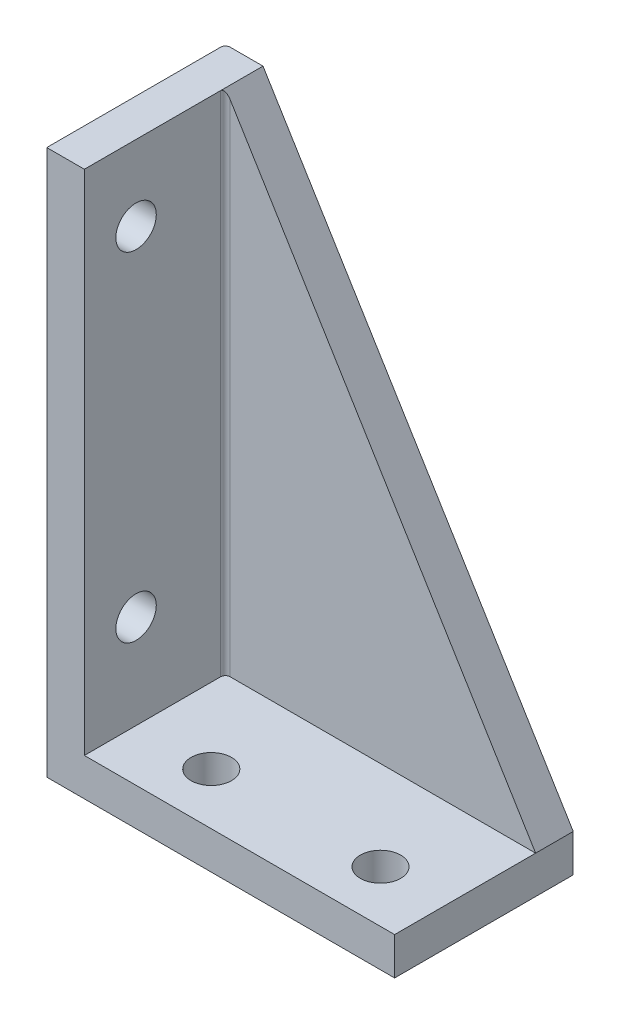
ISO-10303-21;
HEADER;
FILE_DESCRIPTION(('STEP AP214'),'2;1');
FILE_NAME('part.step','',(''),(''),'','','');
FILE_SCHEMA(('AUTOMOTIVE_DESIGN { 1 0 10303 214 1 1 1 1 }'));
ENDSEC;
DATA;
#1=APPLICATION_CONTEXT('core data for automotive mechanical design processes');
#2=APPLICATION_PROTOCOL_DEFINITION('international standard','automotive_design',2000,#1);
#3=PRODUCT_CONTEXT('',#1,'mechanical');
#4=PRODUCT('Part','Part','',(#3));
#5=PRODUCT_RELATED_PRODUCT_CATEGORY('part','',(#4));
#6=PRODUCT_DEFINITION_FORMATION('','',#4);
#7=PRODUCT_DEFINITION_CONTEXT('part definition',#1,'design');
#8=PRODUCT_DEFINITION('design','',#6,#7);
#9=PRODUCT_DEFINITION_SHAPE('','',#8);
#10=(LENGTH_UNIT() NAMED_UNIT(*) SI_UNIT(.MILLI.,.METRE.));
#11=(NAMED_UNIT(*) PLANE_ANGLE_UNIT() SI_UNIT($,.RADIAN.));
#12=(NAMED_UNIT(*) SI_UNIT($,.STERADIAN.) SOLID_ANGLE_UNIT());
#13=UNCERTAINTY_MEASURE_WITH_UNIT(LENGTH_MEASURE(1.E-05),#10,'distance_accuracy_value','');
#14=(GEOMETRIC_REPRESENTATION_CONTEXT(3) GLOBAL_UNCERTAINTY_ASSIGNED_CONTEXT((#13)) GLOBAL_UNIT_ASSIGNED_CONTEXT((#10,
#11,#12)) REPRESENTATION_CONTEXT('',''));
#15=CARTESIAN_POINT('',(0.,0.,0.));
#16=DIRECTION('',(0.,0.,1.));
#17=DIRECTION('',(1.,0.,0.));
#18=AXIS2_PLACEMENT_3D('',#15,#16,#17);
#19=CARTESIAN_POINT('',(0.,58.,30.));
#20=DIRECTION('',(0.,-1.,0.));
#21=DIRECTION('',(0.,0.,-1.));
#22=AXIS2_PLACEMENT_3D('',#19,#20,#21);
#23=PLANE('',#22);
#24=DIRECTION('',(1.,0.,0.));
#25=VECTOR('',#24,1.);
#26=CARTESIAN_POINT('',(37.,58.,13.));
#27=LINE('',#26,#25);
#28=CARTESIAN_POINT('',(0.5,58.,13.));
#29=VERTEX_POINT('',#28);
#30=CARTESIAN_POINT('',(4.00000000000001,58.,13.));
#31=VERTEX_POINT('',#30);
#32=EDGE_CURVE('E137',#29,#31,#27,.T.);
#33=ORIENTED_EDGE('',*,*,#32,.F.);
#34=CARTESIAN_POINT('',(0.5,58.,13.5));
#35=DIRECTION('',(0.,-1.,0.));
#36=DIRECTION('',(0.,0.,-1.));
#37=AXIS2_PLACEMENT_3D('',#34,#35,#36);
#38=CIRCLE('',#37,0.5);
#39=CARTESIAN_POINT('',(0.,58.,13.5));
#40=VERTEX_POINT('',#39);
#41=EDGE_CURVE('E198',#29,#40,#38,.F.);
#42=ORIENTED_EDGE('',*,*,#41,.T.);
#43=DIRECTION('',(0.,0.,-1.));
#44=VECTOR('',#43,1.);
#45=CARTESIAN_POINT('',(0.,58.,30.));
#46=LINE('',#45,#44);
#47=CARTESIAN_POINT('',(0.,58.,32.));
#48=VERTEX_POINT('',#47);
#49=EDGE_CURVE('E188',#48,#40,#46,.T.);
#50=ORIENTED_EDGE('',*,*,#49,.F.);
#51=DIRECTION('',(-1.,0.,0.));
#52=VECTOR('',#51,1.);
#53=CARTESIAN_POINT('',(0.,58.,32.));
#54=LINE('',#53,#52);
#55=CARTESIAN_POINT('',(4.,58.,32.));
#56=VERTEX_POINT('',#55);
#57=EDGE_CURVE('E127',#56,#48,#54,.T.);
#58=ORIENTED_EDGE('',*,*,#57,.F.);
#59=DIRECTION('',(0.,0.,-1.));
#60=VECTOR('',#59,1.);
#61=CARTESIAN_POINT('',(4.,58.,0.));
#62=LINE('',#61,#60);
#63=CARTESIAN_POINT('',(4.,58.,17.5));
#64=VERTEX_POINT('',#63);
#65=EDGE_CURVE('E179',#56,#64,#62,.T.);
#66=ORIENTED_EDGE('',*,*,#65,.T.);
#67=DIRECTION('',(0.,0.,-1.));
#68=VECTOR('',#67,1.);
#69=CARTESIAN_POINT('',(4.,58.,59.));
#70=LINE('',#69,#68);
#71=EDGE_CURVE('E174',#64,#31,#70,.T.);
#72=ORIENTED_EDGE('',*,*,#71,.T.);
#73=EDGE_LOOP('',(#33,#42,#50,#58,#66,#72));
#74=FACE_BOUND('',#73,.T.);
#75=ADVANCED_FACE('F34',(#74),#23,.F.);
#76=CARTESIAN_POINT('',(37.,0.,30.));
#77=DIRECTION('',(-1.,0.,0.));
#78=DIRECTION('',(0.,0.,1.));
#79=AXIS2_PLACEMENT_3D('',#76,#77,#78);
#80=PLANE('',#79);
#81=DIRECTION('',(0.,-1.,0.));
#82=VECTOR('',#81,1.);
#83=CARTESIAN_POINT('',(37.,58.,13.));
#84=LINE('',#83,#82);
#85=CARTESIAN_POINT('',(37.,4.,13.));
#86=VERTEX_POINT('',#85);
#87=CARTESIAN_POINT('',(37.,0.,13.));
#88=VERTEX_POINT('',#87);
#89=EDGE_CURVE('E139',#86,#88,#84,.T.);
#90=ORIENTED_EDGE('',*,*,#89,.F.);
#91=DIRECTION('',(0.,0.,-1.));
#92=VECTOR('',#91,1.);
#93=CARTESIAN_POINT('',(37.,4.,59.));
#94=LINE('',#93,#92);
#95=CARTESIAN_POINT('',(37.,4.,17.));
#96=VERTEX_POINT('',#95);
#97=EDGE_CURVE('E171',#96,#86,#94,.T.);
#98=ORIENTED_EDGE('',*,*,#97,.F.);
#99=DIRECTION('',(0.,0.,-1.));
#100=VECTOR('',#99,1.);
#101=CARTESIAN_POINT('',(37.,4.,0.));
#102=LINE('',#101,#100);
#103=CARTESIAN_POINT('',(37.,4.,32.));
#104=VERTEX_POINT('',#103);
#105=EDGE_CURVE('E183',#104,#96,#102,.T.);
#106=ORIENTED_EDGE('',*,*,#105,.F.);
#107=DIRECTION('',(0.,1.,0.));
#108=VECTOR('',#107,1.);
#109=CARTESIAN_POINT('',(37.,4.,32.));
#110=LINE('',#109,#108);
#111=CARTESIAN_POINT('',(37.,0.,32.));
#112=VERTEX_POINT('',#111);
#113=EDGE_CURVE('E121',#112,#104,#110,.T.);
#114=ORIENTED_EDGE('',*,*,#113,.F.);
#115=DIRECTION('',(0.,0.,-1.));
#116=VECTOR('',#115,1.);
#117=CARTESIAN_POINT('',(37.,0.,30.));
#118=LINE('',#117,#116);
#119=EDGE_CURVE('E111',#112,#88,#118,.T.);
#120=ORIENTED_EDGE('',*,*,#119,.T.);
#121=EDGE_LOOP('',(#90,#98,#106,#114,#120));
#122=FACE_BOUND('',#121,.T.);
#123=ADVANCED_FACE('F232',(#122),#80,.F.);
#124=CARTESIAN_POINT('',(0.,0.,30.));
#125=DIRECTION('',(1.,0.,0.));
#126=DIRECTION('',(0.,0.,-1.));
#127=AXIS2_PLACEMENT_3D('',#124,#125,#126);
#128=PLANE('',#127);
#129=CARTESIAN_POINT('',(0.,50.,26.5));
#130=DIRECTION('',(1.,0.,0.));
#131=DIRECTION('',(0.,0.,-1.));
#132=AXIS2_PLACEMENT_3D('',#129,#130,#131);
#133=CIRCLE('',#132,2.15);
#134=CARTESIAN_POINT('',(0.,50.,24.35));
#135=VERTEX_POINT('',#134);
#136=EDGE_CURVE('E165',#135,#135,#133,.T.);
#137=ORIENTED_EDGE('',*,*,#136,.T.);
#138=EDGE_LOOP('',(#137));
#139=FACE_BOUND('',#138,.T.);
#140=CARTESIAN_POINT('',(0.,14.,26.5));
#141=DIRECTION('',(1.,0.,0.));
#142=DIRECTION('',(0.,0.,-1.));
#143=AXIS2_PLACEMENT_3D('',#140,#141,#142);
#144=CIRCLE('',#143,2.15);
#145=CARTESIAN_POINT('',(0.,14.,24.35));
#146=VERTEX_POINT('',#145);
#147=EDGE_CURVE('E159',#146,#146,#144,.T.);
#148=ORIENTED_EDGE('',*,*,#147,.T.);
#149=EDGE_LOOP('',(#148));
#150=FACE_BOUND('',#149,.T.);
#151=ORIENTED_EDGE('',*,*,#49,.T.);
#152=DIRECTION('',(0.,-1.,0.));
#153=VECTOR('',#152,1.);
#154=CARTESIAN_POINT('',(0.,0.,13.5));
#155=LINE('',#154,#153);
#156=CARTESIAN_POINT('',(0.,0.,13.5));
#157=VERTEX_POINT('',#156);
#158=EDGE_CURVE('E109',#40,#157,#155,.T.);
#159=ORIENTED_EDGE('',*,*,#158,.T.);
#160=DIRECTION('',(0.,0.,-1.));
#161=VECTOR('',#160,1.);
#162=CARTESIAN_POINT('',(0.,0.,30.));
#163=LINE('',#162,#161);
#164=CARTESIAN_POINT('',(0.,0.,32.));
#165=VERTEX_POINT('',#164);
#166=EDGE_CURVE('E102',#165,#157,#163,.T.);
#167=ORIENTED_EDGE('',*,*,#166,.F.);
#168=DIRECTION('',(0.,-1.,0.));
#169=VECTOR('',#168,1.);
#170=CARTESIAN_POINT('',(0.,0.,32.));
#171=LINE('',#170,#169);
#172=EDGE_CURVE('E107',#48,#165,#171,.T.);
#173=ORIENTED_EDGE('',*,*,#172,.F.);
#174=EDGE_LOOP('',(#151,#159,#167,#173));
#175=FACE_BOUND('',#174,.T.);
#176=ADVANCED_FACE('F105',(#139,#150,#175),#128,.F.);
#177=CARTESIAN_POINT('',(0.,0.,30.));
#178=DIRECTION('',(0.,1.,0.));
#179=DIRECTION('',(0.,0.,1.));
#180=AXIS2_PLACEMENT_3D('',#177,#178,#179);
#181=PLANE('',#180);
#182=CARTESIAN_POINT('',(30.,0.,26.5));
#183=DIRECTION('',(0.,1.,0.));
#184=DIRECTION('',(0.,0.,1.));
#185=AXIS2_PLACEMENT_3D('',#182,#183,#184);
#186=CIRCLE('',#185,2.15);
#187=CARTESIAN_POINT('',(30.,0.,28.65));
#188=VERTEX_POINT('',#187);
#189=EDGE_CURVE('E153',#188,#188,#186,.T.);
#190=ORIENTED_EDGE('',*,*,#189,.T.);
#191=EDGE_LOOP('',(#190));
#192=FACE_BOUND('',#191,.T.);
#193=CARTESIAN_POINT('',(12.,0.,26.5));
#194=DIRECTION('',(0.,1.,0.));
#195=DIRECTION('',(0.,0.,1.));
#196=AXIS2_PLACEMENT_3D('',#193,#194,#195);
#197=CIRCLE('',#196,2.15);
#198=CARTESIAN_POINT('',(12.,0.,28.65));
#199=VERTEX_POINT('',#198);
#200=EDGE_CURVE('E147',#199,#199,#197,.T.);
#201=ORIENTED_EDGE('',*,*,#200,.T.);
#202=EDGE_LOOP('',(#201));
#203=FACE_BOUND('',#202,.T.);
#204=ORIENTED_EDGE('',*,*,#166,.T.);
#205=CARTESIAN_POINT('',(0.5,0.,13.5));
#206=DIRECTION('',(0.,1.,0.));
#207=DIRECTION('',(0.,0.,1.));
#208=AXIS2_PLACEMENT_3D('',#205,#206,#207);
#209=CIRCLE('',#208,0.5);
#210=CARTESIAN_POINT('',(0.5,0.,13.));
#211=VERTEX_POINT('',#210);
#212=EDGE_CURVE('E194',#157,#211,#209,.F.);
#213=ORIENTED_EDGE('',*,*,#212,.T.);
#214=DIRECTION('',(-1.,0.,0.));
#215=VECTOR('',#214,1.);
#216=CARTESIAN_POINT('',(0.,0.,13.));
#217=LINE('',#216,#215);
#218=EDGE_CURVE('E141',#88,#211,#217,.T.);
#219=ORIENTED_EDGE('',*,*,#218,.F.);
#220=ORIENTED_EDGE('',*,*,#119,.F.);
#221=DIRECTION('',(1.,0.,0.));
#222=VECTOR('',#221,1.);
#223=CARTESIAN_POINT('',(37.,0.,32.));
#224=LINE('',#223,#222);
#225=EDGE_CURVE('E114',#165,#112,#224,.T.);
#226=ORIENTED_EDGE('',*,*,#225,.F.);
#227=EDGE_LOOP('',(#204,#213,#219,#220,#226));
#228=FACE_BOUND('',#227,.T.);
#229=ADVANCED_FACE('F115',(#192,#203,#228),#181,.F.);
#230=CARTESIAN_POINT('',(0.,4.,13.));
#231=DIRECTION('',(0.,0.,-1.));
#232=DIRECTION('',(-1.,0.,0.));
#233=AXIS2_PLACEMENT_3D('',#230,#231,#232);
#234=PLANE('',#233);
#235=ORIENTED_EDGE('',*,*,#218,.T.);
#236=DIRECTION('',(0.,-1.,0.));
#237=VECTOR('',#236,1.);
#238=CARTESIAN_POINT('',(0.5,58.,13.));
#239=LINE('',#238,#237);
#240=EDGE_CURVE('E196',#211,#29,#239,.F.);
#241=ORIENTED_EDGE('',*,*,#240,.T.);
#242=ORIENTED_EDGE('',*,*,#32,.T.);
#243=DIRECTION('',(0.521450009453975,-0.853281833651959,0.));
#244=VECTOR('',#243,1.);
#245=CARTESIAN_POINT('',(4.,58.,13.));
#246=LINE('',#245,#244);
#247=EDGE_CURVE('E168',#31,#86,#246,.T.);
#248=ORIENTED_EDGE('',*,*,#247,.T.);
#249=ORIENTED_EDGE('',*,*,#89,.T.);
#250=EDGE_LOOP('',(#235,#241,#242,#248,#249));
#251=FACE_BOUND('',#250,.T.);
#252=ADVANCED_FACE('F220',(#251),#234,.T.);
#253=CARTESIAN_POINT('',(0.,4.,17.));
#254=DIRECTION('',(0.,0.,-1.));
#255=DIRECTION('',(-1.,0.,0.));
#256=AXIS2_PLACEMENT_3D('',#253,#254,#255);
#257=PLANE('',#256);
#258=DIRECTION('',(0.521450009453975,-0.853281833651959,0.));
#259=VECTOR('',#258,1.);
#260=CARTESIAN_POINT('',(26.9393258426966,20.4629213483146,17.));
#261=LINE('',#260,#259);
#262=CARTESIAN_POINT('',(4.5,57.1818181818182,17.));
#263=VERTEX_POINT('',#262);
#264=EDGE_CURVE('E177',#263,#96,#261,.T.);
#265=ORIENTED_EDGE('',*,*,#264,.F.);
#266=DIRECTION('',(0.,1.,0.));
#267=VECTOR('',#266,1.);
#268=CARTESIAN_POINT('',(4.5,4.,17.));
#269=LINE('',#268,#267);
#270=CARTESIAN_POINT('',(4.5,4.,17.));
#271=VERTEX_POINT('',#270);
#272=EDGE_CURVE('E50',#263,#271,#269,.F.);
#273=ORIENTED_EDGE('',*,*,#272,.T.);
#274=DIRECTION('',(-1.,0.,0.));
#275=VECTOR('',#274,1.);
#276=CARTESIAN_POINT('',(0.,4.,17.));
#277=LINE('',#276,#275);
#278=EDGE_CURVE('E186',#96,#271,#277,.T.);
#279=ORIENTED_EDGE('',*,*,#278,.F.);
#280=EDGE_LOOP('',(#265,#273,#279));
#281=FACE_BOUND('',#280,.T.);
#282=ADVANCED_FACE('F218',(#281),#257,.F.);
#283=CARTESIAN_POINT('',(4.,4.,0.));
#284=DIRECTION('',(1.,0.,0.));
#285=DIRECTION('',(0.,0.,-1.));
#286=AXIS2_PLACEMENT_3D('',#283,#284,#285);
#287=PLANE('',#286);
#288=CARTESIAN_POINT('',(4.,14.,26.5));
#289=DIRECTION('',(1.,0.,0.));
#290=DIRECTION('',(0.,0.,-1.));
#291=AXIS2_PLACEMENT_3D('',#288,#289,#290);
#292=CIRCLE('',#291,2.14999999999999);
#293=CARTESIAN_POINT('',(4.,14.,24.35));
#294=VERTEX_POINT('',#293);
#295=EDGE_CURVE('E156',#294,#294,#292,.T.);
#296=ORIENTED_EDGE('',*,*,#295,.F.);
#297=EDGE_LOOP('',(#296));
#298=FACE_BOUND('',#297,.T.);
#299=CARTESIAN_POINT('',(4.,50.,26.5));
#300=DIRECTION('',(1.,0.,0.));
#301=DIRECTION('',(0.,0.,-1.));
#302=AXIS2_PLACEMENT_3D('',#299,#300,#301);
#303=CIRCLE('',#302,2.14999999999999);
#304=CARTESIAN_POINT('',(4.,50.,24.35));
#305=VERTEX_POINT('',#304);
#306=EDGE_CURVE('E162',#305,#305,#303,.T.);
#307=ORIENTED_EDGE('',*,*,#306,.F.);
#308=EDGE_LOOP('',(#307));
#309=FACE_BOUND('',#308,.T.);
#310=DIRECTION('',(0.,0.,-1.));
#311=VECTOR('',#310,1.);
#312=CARTESIAN_POINT('',(4.,4.,0.));
#313=LINE('',#312,#311);
#314=CARTESIAN_POINT('',(4.,4.,32.));
#315=VERTEX_POINT('',#314);
#316=CARTESIAN_POINT('',(4.,4.,17.5));
#317=VERTEX_POINT('',#316);
#318=EDGE_CURVE('E180',#315,#317,#313,.T.);
#319=ORIENTED_EDGE('',*,*,#318,.T.);
#320=DIRECTION('',(0.,1.,0.));
#321=VECTOR('',#320,1.);
#322=CARTESIAN_POINT('',(4.,4.,17.5));
#323=LINE('',#322,#321);
#324=EDGE_CURVE('E200',#317,#64,#323,.T.);
#325=ORIENTED_EDGE('',*,*,#324,.T.);
#326=ORIENTED_EDGE('',*,*,#65,.F.);
#327=DIRECTION('',(0.,1.,0.));
#328=VECTOR('',#327,1.);
#329=CARTESIAN_POINT('',(4.,58.,32.));
#330=LINE('',#329,#328);
#331=EDGE_CURVE('E134',#315,#56,#330,.T.);
#332=ORIENTED_EDGE('',*,*,#331,.F.);
#333=EDGE_LOOP('',(#319,#325,#326,#332));
#334=FACE_BOUND('',#333,.T.);
#335=ADVANCED_FACE('F211',(#298,#309,#334),#287,.T.);
#336=CARTESIAN_POINT('',(0.,4.,0.));
#337=DIRECTION('',(0.,1.,0.));
#338=DIRECTION('',(0.,0.,1.));
#339=AXIS2_PLACEMENT_3D('',#336,#337,#338);
#340=PLANE('',#339);
#341=CARTESIAN_POINT('',(12.,4.,26.5));
#342=DIRECTION('',(0.,1.,0.));
#343=DIRECTION('',(0.,0.,1.));
#344=AXIS2_PLACEMENT_3D('',#341,#342,#343);
#345=CIRCLE('',#344,2.14999999999999);
#346=CARTESIAN_POINT('',(12.,4.,28.65));
#347=VERTEX_POINT('',#346);
#348=EDGE_CURVE('E144',#347,#347,#345,.T.);
#349=ORIENTED_EDGE('',*,*,#348,.F.);
#350=EDGE_LOOP('',(#349));
#351=FACE_BOUND('',#350,.T.);
#352=CARTESIAN_POINT('',(30.,4.,26.5));
#353=DIRECTION('',(0.,1.,0.));
#354=DIRECTION('',(0.,0.,1.));
#355=AXIS2_PLACEMENT_3D('',#352,#353,#354);
#356=CIRCLE('',#355,2.14999999999999);
#357=CARTESIAN_POINT('',(30.,4.,28.65));
#358=VERTEX_POINT('',#357);
#359=EDGE_CURVE('E150',#358,#358,#356,.T.);
#360=ORIENTED_EDGE('',*,*,#359,.F.);
#361=EDGE_LOOP('',(#360));
#362=FACE_BOUND('',#361,.T.);
#363=ORIENTED_EDGE('',*,*,#278,.T.);
#364=CARTESIAN_POINT('',(4.5,4.,17.5));
#365=DIRECTION('',(0.,1.,0.));
#366=DIRECTION('',(0.,0.,1.));
#367=AXIS2_PLACEMENT_3D('',#364,#365,#366);
#368=CIRCLE('',#367,0.5);
#369=EDGE_CURVE('E43',#271,#317,#368,.T.);
#370=ORIENTED_EDGE('',*,*,#369,.T.);
#371=ORIENTED_EDGE('',*,*,#318,.F.);
#372=DIRECTION('',(-1.,0.,0.));
#373=VECTOR('',#372,1.);
#374=CARTESIAN_POINT('',(4.,4.,32.));
#375=LINE('',#374,#373);
#376=EDGE_CURVE('E131',#104,#315,#375,.T.);
#377=ORIENTED_EDGE('',*,*,#376,.F.);
#378=ORIENTED_EDGE('',*,*,#105,.T.);
#379=EDGE_LOOP('',(#363,#370,#371,#377,#378));
#380=FACE_BOUND('',#379,.T.);
#381=ADVANCED_FACE('F205',(#351,#362,#380),#340,.T.);
#382=CARTESIAN_POINT('',(4.,58.,59.));
#383=DIRECTION('',(0.853281833651959,0.521450009453975,0.));
#384=DIRECTION('',(-0.521450009453975,0.853281833651959,0.));
#385=AXIS2_PLACEMENT_3D('',#382,#383,#384);
#386=PLANE('',#385);
#387=ORIENTED_EDGE('',*,*,#71,.F.);
#388=CARTESIAN_POINT('',(4.5,57.1818181818182,17.5));
#389=DIRECTION('',(0.853281833651959,0.521450009453975,0.));
#390=DIRECTION('',(-0.521450009453975,0.853281833651959,0.));
#391=AXIS2_PLACEMENT_3D('',#388,#389,#390);
#392=ELLIPSE('',#391,0.958864686805863,0.5);
#393=EDGE_CURVE('E11',#64,#263,#392,.F.);
#394=ORIENTED_EDGE('',*,*,#393,.T.);
#395=ORIENTED_EDGE('',*,*,#264,.T.);
#396=ORIENTED_EDGE('',*,*,#97,.T.);
#397=ORIENTED_EDGE('',*,*,#247,.F.);
#398=EDGE_LOOP('',(#387,#394,#395,#396,#397));
#399=FACE_BOUND('',#398,.T.);
#400=ADVANCED_FACE('F215',(#399),#386,.T.);
#401=CARTESIAN_POINT('',(4.,50.,26.5));
#402=DIRECTION('',(1.,0.,0.));
#403=DIRECTION('',(0.,0.,-1.));
#404=AXIS2_PLACEMENT_3D('',#401,#402,#403);
#405=CYLINDRICAL_SURFACE('',#404,2.14999999999999);
#406=ORIENTED_EDGE('',*,*,#136,.F.);
#407=EDGE_LOOP('',(#406));
#408=FACE_BOUND('',#407,.T.);
#409=ORIENTED_EDGE('',*,*,#306,.T.);
#410=EDGE_LOOP('',(#409));
#411=FACE_BOUND('',#410,.T.);
#412=ADVANCED_FACE('F272',(#408,#411),#405,.F.);
#413=CARTESIAN_POINT('',(4.,14.,26.5));
#414=DIRECTION('',(1.,0.,0.));
#415=DIRECTION('',(0.,0.,-1.));
#416=AXIS2_PLACEMENT_3D('',#413,#414,#415);
#417=CYLINDRICAL_SURFACE('',#416,2.14999999999999);
#418=ORIENTED_EDGE('',*,*,#147,.F.);
#419=EDGE_LOOP('',(#418));
#420=FACE_BOUND('',#419,.T.);
#421=ORIENTED_EDGE('',*,*,#295,.T.);
#422=EDGE_LOOP('',(#421));
#423=FACE_BOUND('',#422,.T.);
#424=ADVANCED_FACE('F263',(#420,#423),#417,.F.);
#425=CARTESIAN_POINT('',(30.,4.,26.5));
#426=DIRECTION('',(0.,1.,0.));
#427=DIRECTION('',(0.,0.,1.));
#428=AXIS2_PLACEMENT_3D('',#425,#426,#427);
#429=CYLINDRICAL_SURFACE('',#428,2.14999999999999);
#430=ORIENTED_EDGE('',*,*,#189,.F.);
#431=EDGE_LOOP('',(#430));
#432=FACE_BOUND('',#431,.T.);
#433=ORIENTED_EDGE('',*,*,#359,.T.);
#434=EDGE_LOOP('',(#433));
#435=FACE_BOUND('',#434,.T.);
#436=ADVANCED_FACE('F255',(#432,#435),#429,.F.);
#437=CARTESIAN_POINT('',(12.,4.,26.5));
#438=DIRECTION('',(0.,1.,0.));
#439=DIRECTION('',(0.,0.,1.));
#440=AXIS2_PLACEMENT_3D('',#437,#438,#439);
#441=CYLINDRICAL_SURFACE('',#440,2.14999999999999);
#442=ORIENTED_EDGE('',*,*,#200,.F.);
#443=EDGE_LOOP('',(#442));
#444=FACE_BOUND('',#443,.T.);
#445=ORIENTED_EDGE('',*,*,#348,.T.);
#446=EDGE_LOOP('',(#445));
#447=FACE_BOUND('',#446,.T.);
#448=ADVANCED_FACE('F249',(#444,#447),#441,.F.);
#449=CARTESIAN_POINT('',(0.5,0.,13.5));
#450=DIRECTION('',(0.,1.,0.));
#451=DIRECTION('',(0.,0.,1.));
#452=AXIS2_PLACEMENT_3D('',#449,#450,#451);
#453=CYLINDRICAL_SURFACE('',#452,0.5);
#454=ORIENTED_EDGE('',*,*,#41,.F.);
#455=ORIENTED_EDGE('',*,*,#240,.F.);
#456=ORIENTED_EDGE('',*,*,#212,.F.);
#457=ORIENTED_EDGE('',*,*,#158,.F.);
#458=EDGE_LOOP('',(#454,#455,#456,#457));
#459=FACE_BOUND('',#458,.T.);
#460=ADVANCED_FACE('F247',(#459),#453,.T.);
#461=CARTESIAN_POINT('',(4.5,4.,17.5));
#462=DIRECTION('',(0.,1.,0.));
#463=DIRECTION('',(0.,0.,1.));
#464=AXIS2_PLACEMENT_3D('',#461,#462,#463);
#465=CYLINDRICAL_SURFACE('',#464,0.5);
#466=ORIENTED_EDGE('',*,*,#369,.F.);
#467=ORIENTED_EDGE('',*,*,#272,.F.);
#468=ORIENTED_EDGE('',*,*,#393,.F.);
#469=ORIENTED_EDGE('',*,*,#324,.F.);
#470=EDGE_LOOP('',(#466,#467,#468,#469));
#471=FACE_BOUND('',#470,.T.);
#472=ADVANCED_FACE('F36',(#471),#465,.F.);
#473=CARTESIAN_POINT('',(0.,0.,32.));
#474=DIRECTION('',(0.,0.,-1.));
#475=DIRECTION('',(-1.,0.,0.));
#476=AXIS2_PLACEMENT_3D('',#473,#474,#475);
#477=PLANE('',#476);
#478=ORIENTED_EDGE('',*,*,#172,.T.);
#479=ORIENTED_EDGE('',*,*,#225,.T.);
#480=ORIENTED_EDGE('',*,*,#113,.T.);
#481=ORIENTED_EDGE('',*,*,#376,.T.);
#482=ORIENTED_EDGE('',*,*,#331,.T.);
#483=ORIENTED_EDGE('',*,*,#57,.T.);
#484=EDGE_LOOP('',(#478,#479,#480,#481,#482,#483));
#485=FACE_BOUND('',#484,.T.);
#486=ADVANCED_FACE('F124',(#485),#477,.F.);
#487=CLOSED_SHELL('',(#75,#123,#176,#229,#252,#282,#335,#381,#400,#412,#424,#436,#448,#460,#472,#486));
#488=MANIFOLD_SOLID_BREP('B2',#487);
#489=ADVANCED_BREP_SHAPE_REPRESENTATION('',(#18,#488),#14);
#490=SHAPE_DEFINITION_REPRESENTATION(#9,#489);
ENDSEC;
END-ISO-10303-21;
